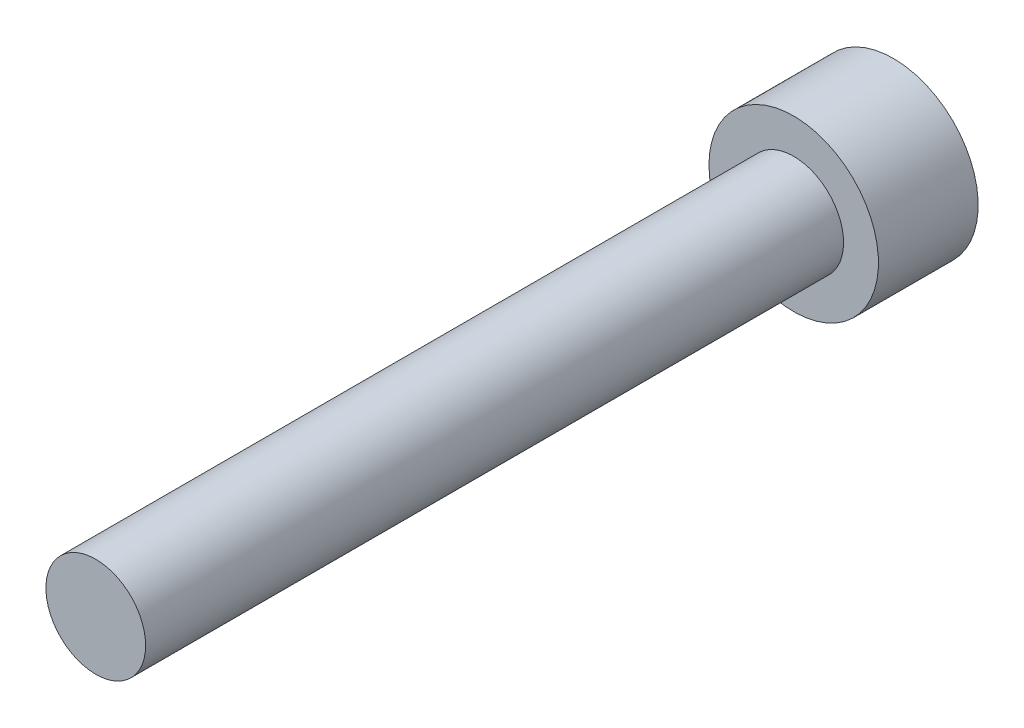
ISO-10303-21;
HEADER;
FILE_DESCRIPTION(('STEP AP214'),'2;1');
FILE_NAME('part.step','',(''),(''),'','','');
FILE_SCHEMA(('AUTOMOTIVE_DESIGN { 1 0 10303 214 1 1 1 1 }'));
ENDSEC;
DATA;
#1=APPLICATION_CONTEXT('core data for automotive mechanical design processes');
#2=APPLICATION_PROTOCOL_DEFINITION('international standard','automotive_design',2000,#1);
#3=PRODUCT_CONTEXT('',#1,'mechanical');
#4=PRODUCT('Part','Part','',(#3));
#5=PRODUCT_RELATED_PRODUCT_CATEGORY('part','',(#4));
#6=PRODUCT_DEFINITION_FORMATION('','',#4);
#7=PRODUCT_DEFINITION_CONTEXT('part definition',#1,'design');
#8=PRODUCT_DEFINITION('design','',#6,#7);
#9=PRODUCT_DEFINITION_SHAPE('','',#8);
#10=(LENGTH_UNIT() NAMED_UNIT(*) SI_UNIT(.MILLI.,.METRE.));
#11=(NAMED_UNIT(*) PLANE_ANGLE_UNIT() SI_UNIT($,.RADIAN.));
#12=(NAMED_UNIT(*) SI_UNIT($,.STERADIAN.) SOLID_ANGLE_UNIT());
#13=UNCERTAINTY_MEASURE_WITH_UNIT(LENGTH_MEASURE(1.E-05),#10,'distance_accuracy_value','');
#14=(GEOMETRIC_REPRESENTATION_CONTEXT(3) GLOBAL_UNCERTAINTY_ASSIGNED_CONTEXT((#13)) GLOBAL_UNIT_ASSIGNED_CONTEXT((#10,
#11,#12)) REPRESENTATION_CONTEXT('',''));
#15=CARTESIAN_POINT('',(0.,0.,0.));
#16=DIRECTION('',(0.,0.,1.));
#17=DIRECTION('',(1.,0.,0.));
#18=AXIS2_PLACEMENT_3D('',#15,#16,#17);
#19=CARTESIAN_POINT('',(0.,0.,-5.));
#20=DIRECTION('',(0.,0.,1.));
#21=DIRECTION('',(1.,0.,0.));
#22=AXIS2_PLACEMENT_3D('',#19,#20,#21);
#23=PLANE('',#22);
#24=CARTESIAN_POINT('',(0.,0.,-5.));
#25=DIRECTION('',(0.,0.,-1.));
#26=DIRECTION('',(-1.,0.,0.));
#27=AXIS2_PLACEMENT_3D('',#24,#25,#26);
#28=CIRCLE('',#27,4.25);
#29=CARTESIAN_POINT('',(-4.25,0.,-5.));
#30=VERTEX_POINT('',#29);
#31=EDGE_CURVE('E18',#30,#30,#28,.F.);
#32=ORIENTED_EDGE('',*,*,#31,.F.);
#33=EDGE_LOOP('',(#32));
#34=FACE_BOUND('',#33,.T.);
#35=ADVANCED_FACE('F15',(#34),#23,.F.);
#36=CARTESIAN_POINT('',(0.,0.,0.));
#37=DIRECTION('',(0.,0.,-1.));
#38=DIRECTION('',(-1.,0.,0.));
#39=AXIS2_PLACEMENT_3D('',#36,#37,#38);
#40=CYLINDRICAL_SURFACE('',#39,4.25);
#41=CARTESIAN_POINT('',(0.,0.,0.));
#42=DIRECTION('',(0.,0.,-1.));
#43=DIRECTION('',(-1.,0.,0.));
#44=AXIS2_PLACEMENT_3D('',#41,#42,#43);
#45=CIRCLE('',#44,4.25);
#46=CARTESIAN_POINT('',(-4.25,0.,0.));
#47=VERTEX_POINT('',#46);
#48=EDGE_CURVE('E27',#47,#47,#45,.F.);
#49=ORIENTED_EDGE('',*,*,#48,.F.);
#50=EDGE_LOOP('',(#49));
#51=FACE_BOUND('',#50,.T.);
#52=ORIENTED_EDGE('',*,*,#31,.T.);
#53=EDGE_LOOP('',(#52));
#54=FACE_BOUND('',#53,.T.);
#55=ADVANCED_FACE('F35',(#51,#54),#40,.T.);
#56=CARTESIAN_POINT('',(0.,0.,35.));
#57=DIRECTION('',(0.,0.,1.));
#58=DIRECTION('',(1.,0.,0.));
#59=AXIS2_PLACEMENT_3D('',#56,#57,#58);
#60=PLANE('',#59);
#61=CARTESIAN_POINT('',(0.,0.,35.));
#62=DIRECTION('',(0.,0.,1.));
#63=DIRECTION('',(1.,0.,0.));
#64=AXIS2_PLACEMENT_3D('',#61,#62,#63);
#65=CIRCLE('',#64,2.5);
#66=CARTESIAN_POINT('',(2.5,0.,35.));
#67=VERTEX_POINT('',#66);
#68=EDGE_CURVE('E22',#67,#67,#65,.F.);
#69=ORIENTED_EDGE('',*,*,#68,.F.);
#70=EDGE_LOOP('',(#69));
#71=FACE_BOUND('',#70,.T.);
#72=ADVANCED_FACE('F42',(#71),#60,.T.);
#73=CARTESIAN_POINT('',(0.,0.,0.));
#74=DIRECTION('',(0.,0.,1.));
#75=DIRECTION('',(1.,0.,0.));
#76=AXIS2_PLACEMENT_3D('',#73,#74,#75);
#77=PLANE('',#76);
#78=CARTESIAN_POINT('',(0.,0.,0.));
#79=DIRECTION('',(0.,0.,1.));
#80=DIRECTION('',(1.,0.,0.));
#81=AXIS2_PLACEMENT_3D('',#78,#79,#80);
#82=CIRCLE('',#81,2.5);
#83=CARTESIAN_POINT('',(2.5,0.,0.));
#84=VERTEX_POINT('',#83);
#85=EDGE_CURVE('E10',#84,#84,#82,.T.);
#86=ORIENTED_EDGE('',*,*,#85,.F.);
#87=EDGE_LOOP('',(#86));
#88=FACE_BOUND('',#87,.T.);
#89=ORIENTED_EDGE('',*,*,#48,.T.);
#90=EDGE_LOOP('',(#89));
#91=FACE_BOUND('',#90,.T.);
#92=ADVANCED_FACE('F46',(#88,#91),#77,.T.);
#93=CARTESIAN_POINT('',(0.,0.,0.));
#94=DIRECTION('',(0.,0.,1.));
#95=DIRECTION('',(1.,0.,0.));
#96=AXIS2_PLACEMENT_3D('',#93,#94,#95);
#97=CYLINDRICAL_SURFACE('',#96,2.5);
#98=ORIENTED_EDGE('',*,*,#85,.T.);
#99=EDGE_LOOP('',(#98));
#100=FACE_BOUND('',#99,.T.);
#101=ORIENTED_EDGE('',*,*,#68,.T.);
#102=EDGE_LOOP('',(#101));
#103=FACE_BOUND('',#102,.T.);
#104=ADVANCED_FACE('F44',(#100,#103),#97,.T.);
#105=CLOSED_SHELL('',(#35,#55,#72,#92,#104));
#106=MANIFOLD_SOLID_BREP('B1',#105);
#107=ADVANCED_BREP_SHAPE_REPRESENTATION('',(#18,#106),#14);
#108=SHAPE_DEFINITION_REPRESENTATION(#9,#107);
ENDSEC;
END-ISO-10303-21;
